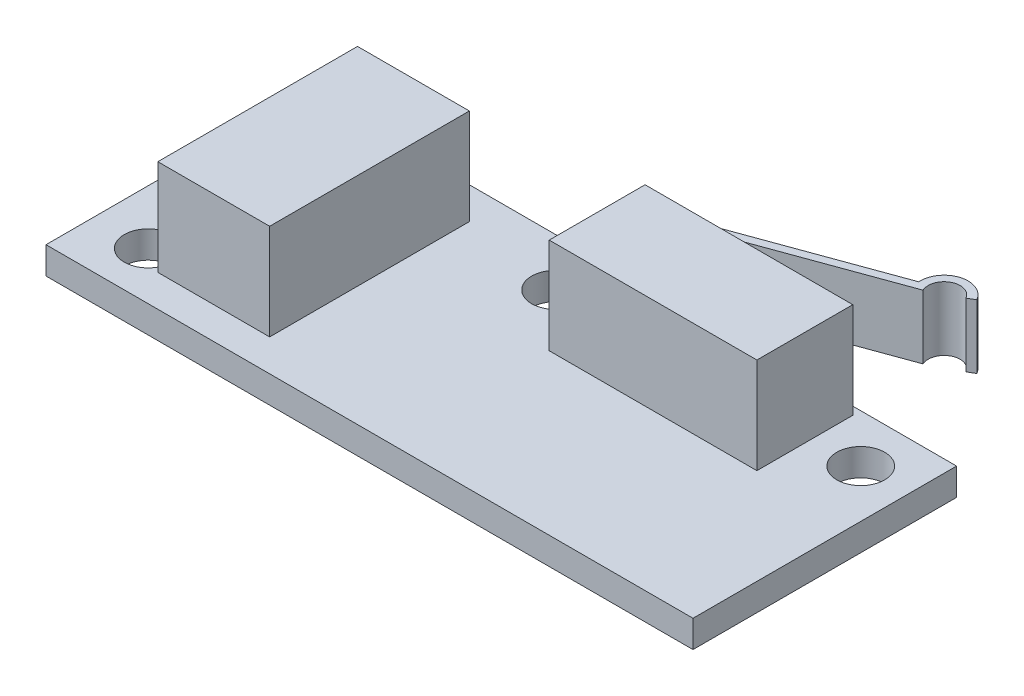
ISO-10303-21;
HEADER;
FILE_DESCRIPTION(('STEP AP214'),'2;1');
FILE_NAME('part.step','',(''),(''),'','','');
FILE_SCHEMA(('AUTOMOTIVE_DESIGN { 1 0 10303 214 1 1 1 1 }'));
ENDSEC;
DATA;
#1=APPLICATION_CONTEXT('core data for automotive mechanical design processes');
#2=APPLICATION_PROTOCOL_DEFINITION('international standard','automotive_design',2000,#1);
#3=PRODUCT_CONTEXT('',#1,'mechanical');
#4=PRODUCT('Part','Part','',(#3));
#5=PRODUCT_RELATED_PRODUCT_CATEGORY('part','',(#4));
#6=PRODUCT_DEFINITION_FORMATION('','',#4);
#7=PRODUCT_DEFINITION_CONTEXT('part definition',#1,'design');
#8=PRODUCT_DEFINITION('design','',#6,#7);
#9=PRODUCT_DEFINITION_SHAPE('','',#8);
#10=(LENGTH_UNIT() NAMED_UNIT(*) SI_UNIT(.MILLI.,.METRE.));
#11=(NAMED_UNIT(*) PLANE_ANGLE_UNIT() SI_UNIT($,.RADIAN.));
#12=(NAMED_UNIT(*) SI_UNIT($,.STERADIAN.) SOLID_ANGLE_UNIT());
#13=UNCERTAINTY_MEASURE_WITH_UNIT(LENGTH_MEASURE(1.E-05),#10,'distance_accuracy_value','');
#14=(GEOMETRIC_REPRESENTATION_CONTEXT(3) GLOBAL_UNCERTAINTY_ASSIGNED_CONTEXT((#13)) GLOBAL_UNIT_ASSIGNED_CONTEXT((#10,
#11,#12)) REPRESENTATION_CONTEXT('',''));
#15=CARTESIAN_POINT('',(0.,0.,0.));
#16=DIRECTION('',(0.,0.,1.));
#17=DIRECTION('',(1.,0.,0.));
#18=AXIS2_PLACEMENT_3D('',#15,#16,#17);
#19=CARTESIAN_POINT('',(5.,7.7,-14.5));
#20=DIRECTION('',(1.,0.,0.));
#21=DIRECTION('',(0.,0.,-1.));
#22=AXIS2_PLACEMENT_3D('',#19,#20,#21);
#23=PLANE('',#22);
#24=DIRECTION('',(0.,0.,1.));
#25=VECTOR('',#24,1.);
#26=CARTESIAN_POINT('',(5.,1.7,-14.5));
#27=LINE('',#26,#25);
#28=CARTESIAN_POINT('',(5.,1.7,-14.5));
#29=VERTEX_POINT('',#28);
#30=CARTESIAN_POINT('',(5.,1.7,-2.));
#31=VERTEX_POINT('',#30);
#32=EDGE_CURVE('E153',#29,#31,#27,.T.);
#33=ORIENTED_EDGE('',*,*,#32,.T.);
#34=DIRECTION('',(0.,-1.,0.));
#35=VECTOR('',#34,1.);
#36=CARTESIAN_POINT('',(5.,7.7,-2.));
#37=LINE('',#36,#35);
#38=CARTESIAN_POINT('',(5.,7.7,-2.));
#39=VERTEX_POINT('',#38);
#40=EDGE_CURVE('E12',#39,#31,#37,.T.);
#41=ORIENTED_EDGE('',*,*,#40,.F.);
#42=DIRECTION('',(0.,0.,1.));
#43=VECTOR('',#42,1.);
#44=CARTESIAN_POINT('',(5.,7.7,-14.5));
#45=LINE('',#44,#43);
#46=CARTESIAN_POINT('',(5.,7.7,-14.5));
#47=VERTEX_POINT('',#46);
#48=EDGE_CURVE('E158',#47,#39,#45,.T.);
#49=ORIENTED_EDGE('',*,*,#48,.F.);
#50=DIRECTION('',(0.,-1.,0.));
#51=VECTOR('',#50,1.);
#52=CARTESIAN_POINT('',(5.,7.7,-14.5));
#53=LINE('',#52,#51);
#54=EDGE_CURVE('E164',#47,#29,#53,.T.);
#55=ORIENTED_EDGE('',*,*,#54,.T.);
#56=EDGE_LOOP('',(#33,#41,#49,#55));
#57=FACE_BOUND('',#56,.T.);
#58=DIRECTION('',(0.,0.,1.));
#59=VECTOR('',#58,1.);
#60=CARTESIAN_POINT('',(5.,2.2,-14.5));
#61=LINE('',#60,#59);
#62=CARTESIAN_POINT('',(5.,2.2,-14.));
#63=VERTEX_POINT('',#62);
#64=CARTESIAN_POINT('',(5.,2.2,-2.5));
#65=VERTEX_POINT('',#64);
#66=EDGE_CURVE('E124',#63,#65,#61,.T.);
#67=ORIENTED_EDGE('',*,*,#66,.F.);
#68=DIRECTION('',(0.,-1.,0.));
#69=VECTOR('',#68,1.);
#70=CARTESIAN_POINT('',(5.,7.7,-14.));
#71=LINE('',#70,#69);
#72=CARTESIAN_POINT('',(5.,7.2,-14.));
#73=VERTEX_POINT('',#72);
#74=EDGE_CURVE('E147',#73,#63,#71,.T.);
#75=ORIENTED_EDGE('',*,*,#74,.F.);
#76=DIRECTION('',(0.,0.,1.));
#77=VECTOR('',#76,1.);
#78=CARTESIAN_POINT('',(5.,7.2,-14.5));
#79=LINE('',#78,#77);
#80=CARTESIAN_POINT('',(5.,7.2,-2.5));
#81=VERTEX_POINT('',#80);
#82=EDGE_CURVE('E58',#73,#81,#79,.T.);
#83=ORIENTED_EDGE('',*,*,#82,.T.);
#84=DIRECTION('',(0.,-1.,0.));
#85=VECTOR('',#84,1.);
#86=CARTESIAN_POINT('',(5.,7.7,-2.5));
#87=LINE('',#86,#85);
#88=EDGE_CURVE('E135',#81,#65,#87,.T.);
#89=ORIENTED_EDGE('',*,*,#88,.T.);
#90=EDGE_LOOP('',(#67,#75,#83,#89));
#91=FACE_BOUND('',#90,.T.);
#92=ADVANCED_FACE('F44',(#57,#91),#23,.F.);
#93=CARTESIAN_POINT('',(5.,7.7,-2.));
#94=DIRECTION('',(0.,0.,-1.));
#95=DIRECTION('',(-1.,0.,0.));
#96=AXIS2_PLACEMENT_3D('',#93,#94,#95);
#97=PLANE('',#96);
#98=DIRECTION('',(1.,0.,0.));
#99=VECTOR('',#98,1.);
#100=CARTESIAN_POINT('',(5.,1.7,-2.));
#101=LINE('',#100,#99);
#102=CARTESIAN_POINT('',(12.,1.7,-2.));
#103=VERTEX_POINT('',#102);
#104=EDGE_CURVE('E167',#31,#103,#101,.T.);
#105=ORIENTED_EDGE('',*,*,#104,.T.);
#106=DIRECTION('',(0.,-1.,0.));
#107=VECTOR('',#106,1.);
#108=CARTESIAN_POINT('',(12.,7.7,-2.));
#109=LINE('',#108,#107);
#110=CARTESIAN_POINT('',(12.,7.7,-2.));
#111=VERTEX_POINT('',#110);
#112=EDGE_CURVE('E51',#111,#103,#109,.T.);
#113=ORIENTED_EDGE('',*,*,#112,.F.);
#114=DIRECTION('',(1.,0.,0.));
#115=VECTOR('',#114,1.);
#116=CARTESIAN_POINT('',(5.,7.7,-2.));
#117=LINE('',#116,#115);
#118=EDGE_CURVE('E95',#39,#111,#117,.T.);
#119=ORIENTED_EDGE('',*,*,#118,.F.);
#120=ORIENTED_EDGE('',*,*,#40,.T.);
#121=EDGE_LOOP('',(#105,#113,#119,#120));
#122=FACE_BOUND('',#121,.T.);
#123=ADVANCED_FACE('F196',(#122),#97,.F.);
#124=CARTESIAN_POINT('',(12.,7.7,-14.5));
#125=DIRECTION('',(-1.,0.,0.));
#126=DIRECTION('',(0.,0.,1.));
#127=AXIS2_PLACEMENT_3D('',#124,#125,#126);
#128=PLANE('',#127);
#129=DIRECTION('',(0.,0.,-1.));
#130=VECTOR('',#129,1.);
#131=CARTESIAN_POINT('',(12.,1.7,-14.5));
#132=LINE('',#131,#130);
#133=CARTESIAN_POINT('',(12.,1.7,-14.5));
#134=VERTEX_POINT('',#133);
#135=EDGE_CURVE('E169',#103,#134,#132,.T.);
#136=ORIENTED_EDGE('',*,*,#135,.T.);
#137=DIRECTION('',(0.,-1.,0.));
#138=VECTOR('',#137,1.);
#139=CARTESIAN_POINT('',(12.,7.7,-14.5));
#140=LINE('',#139,#138);
#141=CARTESIAN_POINT('',(12.,7.7,-14.5));
#142=VERTEX_POINT('',#141);
#143=EDGE_CURVE('E173',#142,#134,#140,.T.);
#144=ORIENTED_EDGE('',*,*,#143,.F.);
#145=DIRECTION('',(0.,0.,-1.));
#146=VECTOR('',#145,1.);
#147=CARTESIAN_POINT('',(12.,7.7,-14.5));
#148=LINE('',#147,#146);
#149=EDGE_CURVE('E161',#111,#142,#148,.T.);
#150=ORIENTED_EDGE('',*,*,#149,.F.);
#151=ORIENTED_EDGE('',*,*,#112,.T.);
#152=EDGE_LOOP('',(#136,#144,#150,#151));
#153=FACE_BOUND('',#152,.T.);
#154=ADVANCED_FACE('F178',(#153),#128,.F.);
#155=CARTESIAN_POINT('',(5.,7.7,-14.5));
#156=DIRECTION('',(0.,0.,1.));
#157=DIRECTION('',(1.,0.,0.));
#158=AXIS2_PLACEMENT_3D('',#155,#156,#157);
#159=PLANE('',#158);
#160=DIRECTION('',(-1.,0.,0.));
#161=VECTOR('',#160,1.);
#162=CARTESIAN_POINT('',(5.,1.7,-14.5));
#163=LINE('',#162,#161);
#164=EDGE_CURVE('E88',#134,#29,#163,.T.);
#165=ORIENTED_EDGE('',*,*,#164,.T.);
#166=ORIENTED_EDGE('',*,*,#54,.F.);
#167=DIRECTION('',(-1.,0.,0.));
#168=VECTOR('',#167,1.);
#169=CARTESIAN_POINT('',(5.,7.7,-14.5));
#170=LINE('',#169,#168);
#171=EDGE_CURVE('E67',#142,#47,#170,.T.);
#172=ORIENTED_EDGE('',*,*,#171,.F.);
#173=ORIENTED_EDGE('',*,*,#143,.T.);
#174=EDGE_LOOP('',(#165,#166,#172,#173));
#175=FACE_BOUND('',#174,.T.);
#176=ADVANCED_FACE('F187',(#175),#159,.F.);
#177=CARTESIAN_POINT('',(0.,7.7,0.));
#178=DIRECTION('',(0.,1.,0.));
#179=DIRECTION('',(0.,0.,1.));
#180=AXIS2_PLACEMENT_3D('',#177,#178,#179);
#181=PLANE('',#180);
#182=ORIENTED_EDGE('',*,*,#48,.T.);
#183=ORIENTED_EDGE('',*,*,#118,.T.);
#184=ORIENTED_EDGE('',*,*,#149,.T.);
#185=ORIENTED_EDGE('',*,*,#171,.T.);
#186=EDGE_LOOP('',(#182,#183,#184,#185));
#187=FACE_BOUND('',#186,.T.);
#188=ADVANCED_FACE('F189',(#187),#181,.T.);
#189=CARTESIAN_POINT('',(0.,1.7,0.));
#190=DIRECTION('',(0.,1.,0.));
#191=DIRECTION('',(0.,0.,1.));
#192=AXIS2_PLACEMENT_3D('',#189,#190,#191);
#193=PLANE('',#192);
#194=ORIENTED_EDGE('',*,*,#32,.F.);
#195=ORIENTED_EDGE('',*,*,#164,.F.);
#196=ORIENTED_EDGE('',*,*,#135,.F.);
#197=ORIENTED_EDGE('',*,*,#104,.F.);
#198=EDGE_LOOP('',(#194,#195,#196,#197));
#199=FACE_BOUND('',#198,.T.);
#200=ADVANCED_FACE('F182',(#199),#193,.F.);
#201=CARTESIAN_POINT('',(5.,7.7,-2.5));
#202=DIRECTION('',(0.,0.,-1.));
#203=DIRECTION('',(-1.,0.,0.));
#204=AXIS2_PLACEMENT_3D('',#201,#202,#203);
#205=PLANE('',#204);
#206=DIRECTION('',(1.,0.,0.));
#207=VECTOR('',#206,1.);
#208=CARTESIAN_POINT('',(5.,2.2,-2.5));
#209=LINE('',#208,#207);
#210=CARTESIAN_POINT('',(11.5,2.2,-2.5));
#211=VERTEX_POINT('',#210);
#212=EDGE_CURVE('E117',#65,#211,#209,.T.);
#213=ORIENTED_EDGE('',*,*,#212,.F.);
#214=ORIENTED_EDGE('',*,*,#88,.F.);
#215=DIRECTION('',(1.,0.,0.));
#216=VECTOR('',#215,1.);
#217=CARTESIAN_POINT('',(5.,7.2,-2.5));
#218=LINE('',#217,#216);
#219=CARTESIAN_POINT('',(11.5,7.2,-2.5));
#220=VERTEX_POINT('',#219);
#221=EDGE_CURVE('E132',#81,#220,#218,.T.);
#222=ORIENTED_EDGE('',*,*,#221,.T.);
#223=DIRECTION('',(0.,-1.,0.));
#224=VECTOR('',#223,1.);
#225=CARTESIAN_POINT('',(11.5,7.7,-2.5));
#226=LINE('',#225,#224);
#227=EDGE_CURVE('E130',#220,#211,#226,.T.);
#228=ORIENTED_EDGE('',*,*,#227,.T.);
#229=EDGE_LOOP('',(#213,#214,#222,#228));
#230=FACE_BOUND('',#229,.T.);
#231=ADVANCED_FACE('F131',(#230),#205,.T.);
#232=CARTESIAN_POINT('',(11.5,7.7,-14.5));
#233=DIRECTION('',(-1.,0.,0.));
#234=DIRECTION('',(0.,0.,1.));
#235=AXIS2_PLACEMENT_3D('',#232,#233,#234);
#236=PLANE('',#235);
#237=DIRECTION('',(0.,0.,-1.));
#238=VECTOR('',#237,1.);
#239=CARTESIAN_POINT('',(11.5,2.2,-14.5));
#240=LINE('',#239,#238);
#241=CARTESIAN_POINT('',(11.5,2.2,-14.));
#242=VERTEX_POINT('',#241);
#243=EDGE_CURVE('E121',#211,#242,#240,.T.);
#244=ORIENTED_EDGE('',*,*,#243,.F.);
#245=ORIENTED_EDGE('',*,*,#227,.F.);
#246=DIRECTION('',(0.,0.,-1.));
#247=VECTOR('',#246,1.);
#248=CARTESIAN_POINT('',(11.5,7.2,-14.5));
#249=LINE('',#248,#247);
#250=CARTESIAN_POINT('',(11.5,7.2,-14.));
#251=VERTEX_POINT('',#250);
#252=EDGE_CURVE('E148',#220,#251,#249,.T.);
#253=ORIENTED_EDGE('',*,*,#252,.T.);
#254=DIRECTION('',(0.,-1.,0.));
#255=VECTOR('',#254,1.);
#256=CARTESIAN_POINT('',(11.5,7.7,-14.));
#257=LINE('',#256,#255);
#258=EDGE_CURVE('E136',#251,#242,#257,.T.);
#259=ORIENTED_EDGE('',*,*,#258,.T.);
#260=EDGE_LOOP('',(#244,#245,#253,#259));
#261=FACE_BOUND('',#260,.T.);
#262=ADVANCED_FACE('F138',(#261),#236,.T.);
#263=CARTESIAN_POINT('',(5.,7.7,-14.));
#264=DIRECTION('',(0.,0.,1.));
#265=DIRECTION('',(1.,0.,0.));
#266=AXIS2_PLACEMENT_3D('',#263,#264,#265);
#267=PLANE('',#266);
#268=DIRECTION('',(-1.,0.,0.));
#269=VECTOR('',#268,1.);
#270=CARTESIAN_POINT('',(5.,2.2,-14.));
#271=LINE('',#270,#269);
#272=EDGE_CURVE('E141',#242,#63,#271,.T.);
#273=ORIENTED_EDGE('',*,*,#272,.F.);
#274=ORIENTED_EDGE('',*,*,#258,.F.);
#275=DIRECTION('',(-1.,0.,0.));
#276=VECTOR('',#275,1.);
#277=CARTESIAN_POINT('',(5.,7.2,-14.));
#278=LINE('',#277,#276);
#279=EDGE_CURVE('E149',#251,#73,#278,.T.);
#280=ORIENTED_EDGE('',*,*,#279,.T.);
#281=ORIENTED_EDGE('',*,*,#74,.T.);
#282=EDGE_LOOP('',(#273,#274,#280,#281));
#283=FACE_BOUND('',#282,.T.);
#284=ADVANCED_FACE('F247',(#283),#267,.T.);
#285=CARTESIAN_POINT('',(0.,7.2,0.));
#286=DIRECTION('',(0.,1.,0.));
#287=DIRECTION('',(0.,0.,1.));
#288=AXIS2_PLACEMENT_3D('',#285,#286,#287);
#289=PLANE('',#288);
#290=ORIENTED_EDGE('',*,*,#82,.F.);
#291=ORIENTED_EDGE('',*,*,#279,.F.);
#292=ORIENTED_EDGE('',*,*,#252,.F.);
#293=ORIENTED_EDGE('',*,*,#221,.F.);
#294=EDGE_LOOP('',(#290,#291,#292,#293));
#295=FACE_BOUND('',#294,.T.);
#296=ADVANCED_FACE('F256',(#295),#289,.F.);
#297=CARTESIAN_POINT('',(0.,2.2,0.));
#298=DIRECTION('',(0.,1.,0.));
#299=DIRECTION('',(0.,0.,1.));
#300=AXIS2_PLACEMENT_3D('',#297,#298,#299);
#301=PLANE('',#300);
#302=ORIENTED_EDGE('',*,*,#66,.T.);
#303=ORIENTED_EDGE('',*,*,#212,.T.);
#304=ORIENTED_EDGE('',*,*,#243,.T.);
#305=ORIENTED_EDGE('',*,*,#272,.T.);
#306=EDGE_LOOP('',(#302,#303,#304,#305));
#307=FACE_BOUND('',#306,.T.);
#308=ADVANCED_FACE('F119',(#307),#301,.T.);
#309=CLOSED_SHELL('',(#92,#123,#154,#176,#188,#200,#231,#262,#284,#296,#308));
#310=MANIFOLD_SOLID_BREP('B2',#309);
#311=CARTESIAN_POINT('',(35.8211998261844,7.7,-20.3976832474202));
#312=DIRECTION('',(0.,-1.,0.));
#313=DIRECTION('',(0.,0.,-1.));
#314=AXIS2_PLACEMENT_3D('',#311,#312,#313);
#315=CYLINDRICAL_SURFACE('',#314,1.);
#316=CARTESIAN_POINT('',(35.8211998261844,2.7,-20.3976832474202));
#317=DIRECTION('',(0.,-1.,0.));
#318=DIRECTION('',(0.,0.,-1.));
#319=AXIS2_PLACEMENT_3D('',#316,#317,#318);
#320=CIRCLE('',#319,1.);
#321=CARTESIAN_POINT('',(36.6872252299689,2.7,-20.8976832474202));
#322=VERTEX_POINT('',#321);
#323=CARTESIAN_POINT('',(34.9103640865516,2.7,-19.9849142376731));
#324=VERTEX_POINT('',#323);
#325=EDGE_CURVE('E543',#322,#324,#320,.F.);
#326=ORIENTED_EDGE('',*,*,#325,.F.);
#327=DIRECTION('',(0.,-1.,0.));
#328=VECTOR('',#327,1.);
#329=CARTESIAN_POINT('',(36.6872252299689,7.7,-20.8976832474202));
#330=LINE('',#329,#328);
#331=CARTESIAN_POINT('',(36.6872252299689,6.7,-20.8976832474202));
#332=VERTEX_POINT('',#331);
#333=EDGE_CURVE('E427',#332,#322,#330,.T.);
#334=ORIENTED_EDGE('',*,*,#333,.F.);
#335=CARTESIAN_POINT('',(35.8211998261844,6.7,-20.3976832474202));
#336=DIRECTION('',(0.,-1.,0.));
#337=DIRECTION('',(0.,0.,-1.));
#338=AXIS2_PLACEMENT_3D('',#335,#336,#337);
#339=CIRCLE('',#338,1.);
#340=CARTESIAN_POINT('',(34.9103640865516,6.7,-19.9849142376731));
#341=VERTEX_POINT('',#340);
#342=EDGE_CURVE('E532',#332,#341,#339,.F.);
#343=ORIENTED_EDGE('',*,*,#342,.T.);
#344=DIRECTION('',(0.,-1.,0.));
#345=VECTOR('',#344,1.);
#346=CARTESIAN_POINT('',(34.9103640865516,7.7,-19.9849142376731));
#347=LINE('',#346,#345);
#348=EDGE_CURVE('E435',#341,#324,#347,.T.);
#349=ORIENTED_EDGE('',*,*,#348,.T.);
#350=EDGE_LOOP('',(#326,#334,#343,#349));
#351=FACE_BOUND('',#350,.T.);
#352=ADVANCED_FACE('F282',(#351),#315,.F.);
#353=CARTESIAN_POINT('',(36.6872252299689,7.7,-20.8976832474202));
#354=DIRECTION('',(-0.500000000000004,0.,-0.866025403784436));
#355=DIRECTION('',(-0.866025403784437,0.,0.500000000000004));
#356=AXIS2_PLACEMENT_3D('',#353,#354,#355);
#357=PLANE('',#356);
#358=DIRECTION('',(-0.866025403784437,0.,0.500000000000004));
#359=VECTOR('',#358,1.);
#360=CARTESIAN_POINT('',(36.6872252299689,2.7,-20.8976832474202));
#361=LINE('',#360,#359);
#362=CARTESIAN_POINT('',(37.1202379318611,2.7,-21.1476832474202));
#363=VERTEX_POINT('',#362);
#364=EDGE_CURVE('E545',#363,#322,#361,.T.);
#365=ORIENTED_EDGE('',*,*,#364,.F.);
#366=DIRECTION('',(0.,-1.,0.));
#367=VECTOR('',#366,1.);
#368=CARTESIAN_POINT('',(37.1202379318611,7.7,-21.1476832474202));
#369=LINE('',#368,#367);
#370=CARTESIAN_POINT('',(37.1202379318611,6.7,-21.1476832474202));
#371=VERTEX_POINT('',#370);
#372=EDGE_CURVE('E424',#371,#363,#369,.T.);
#373=ORIENTED_EDGE('',*,*,#372,.F.);
#374=DIRECTION('',(-0.866025403784437,0.,0.500000000000004));
#375=VECTOR('',#374,1.);
#376=CARTESIAN_POINT('',(36.6872252299689,6.7,-20.8976832474202));
#377=LINE('',#376,#375);
#378=EDGE_CURVE('E535',#371,#332,#377,.T.);
#379=ORIENTED_EDGE('',*,*,#378,.T.);
#380=ORIENTED_EDGE('',*,*,#333,.T.);
#381=EDGE_LOOP('',(#365,#373,#379,#380));
#382=FACE_BOUND('',#381,.T.);
#383=ADVANCED_FACE('F593',(#382),#357,.F.);
#384=CARTESIAN_POINT('',(35.8211998261844,7.7,-20.3976832474202));
#385=DIRECTION('',(0.,-1.,0.));
#386=DIRECTION('',(0.,0.,-1.));
#387=AXIS2_PLACEMENT_3D('',#384,#385,#386);
#388=CYLINDRICAL_SURFACE('',#387,1.5);
#389=CARTESIAN_POINT('',(35.8211998261844,2.7,-20.3976832474202));
#390=DIRECTION('',(0.,-1.,0.));
#391=DIRECTION('',(0.,0.,-1.));
#392=AXIS2_PLACEMENT_3D('',#389,#390,#391);
#393=CIRCLE('',#392,1.5);
#394=CARTESIAN_POINT('',(34.3241508389163,2.7,-20.3036389508393));
#395=VERTEX_POINT('',#394);
#396=EDGE_CURVE('E547',#395,#363,#393,.T.);
#397=ORIENTED_EDGE('',*,*,#396,.F.);
#398=DIRECTION('',(0.,-1.,0.));
#399=VECTOR('',#398,1.);
#400=CARTESIAN_POINT('',(34.3241508389163,7.7,-20.3036389508393));
#401=LINE('',#400,#399);
#402=CARTESIAN_POINT('',(34.3241508389163,6.7,-20.3036389508393));
#403=VERTEX_POINT('',#402);
#404=EDGE_CURVE('E422',#403,#395,#401,.T.);
#405=ORIENTED_EDGE('',*,*,#404,.F.);
#406=CARTESIAN_POINT('',(35.8211998261844,6.7,-20.3976832474202));
#407=DIRECTION('',(0.,-1.,0.));
#408=DIRECTION('',(0.,0.,-1.));
#409=AXIS2_PLACEMENT_3D('',#406,#407,#408);
#410=CIRCLE('',#409,1.5);
#411=EDGE_CURVE('E538',#403,#371,#410,.T.);
#412=ORIENTED_EDGE('',*,*,#411,.T.);
#413=ORIENTED_EDGE('',*,*,#372,.T.);
#414=EDGE_LOOP('',(#397,#405,#412,#413));
#415=FACE_BOUND('',#414,.T.);
#416=ADVANCED_FACE('F599',(#415),#388,.T.);
#417=CARTESIAN_POINT('',(0.,1.7,0.));
#418=DIRECTION('',(0.,-1.,0.));
#419=DIRECTION('',(0.,0.,-1.));
#420=AXIS2_PLACEMENT_3D('',#417,#418,#419);
#421=PLANE('',#420);
#422=CARTESIAN_POINT('',(37.5,1.7,-13.5));
#423=DIRECTION('',(0.,1.,0.));
#424=DIRECTION('',(0.,0.,1.));
#425=AXIS2_PLACEMENT_3D('',#422,#423,#424);
#426=CIRCLE('',#425,1.5);
#427=CARTESIAN_POINT('',(37.5,1.7,-12.));
#428=VERTEX_POINT('',#427);
#429=EDGE_CURVE('E451',#428,#428,#426,.T.);
#430=ORIENTED_EDGE('',*,*,#429,.F.);
#431=EDGE_LOOP('',(#430));
#432=FACE_BOUND('',#431,.T.);
#433=CARTESIAN_POINT('',(18.4,1.7,-13.5));
#434=DIRECTION('',(0.,1.,0.));
#435=DIRECTION('',(0.,0.,1.));
#436=AXIS2_PLACEMENT_3D('',#433,#434,#435);
#437=CIRCLE('',#436,1.5);
#438=CARTESIAN_POINT('',(18.4,1.7,-12.));
#439=VERTEX_POINT('',#438);
#440=EDGE_CURVE('E457',#439,#439,#437,.T.);
#441=ORIENTED_EDGE('',*,*,#440,.F.);
#442=EDGE_LOOP('',(#441));
#443=FACE_BOUND('',#442,.T.);
#444=CARTESIAN_POINT('',(3.4,1.7,-13.5));
#445=DIRECTION('',(0.,1.,0.));
#446=DIRECTION('',(0.,0.,1.));
#447=AXIS2_PLACEMENT_3D('',#444,#445,#446);
#448=CIRCLE('',#447,1.5);
#449=CARTESIAN_POINT('',(3.4,1.7,-12.));
#450=VERTEX_POINT('',#449);
#451=EDGE_CURVE('E463',#450,#450,#448,.T.);
#452=ORIENTED_EDGE('',*,*,#451,.F.);
#453=EDGE_LOOP('',(#452));
#454=FACE_BOUND('',#453,.T.);
#455=CARTESIAN_POINT('',(3.4,1.7,-3.));
#456=DIRECTION('',(0.,1.,0.));
#457=DIRECTION('',(0.,0.,1.));
#458=AXIS2_PLACEMENT_3D('',#455,#456,#457);
#459=CIRCLE('',#458,1.5);
#460=CARTESIAN_POINT('',(3.4,1.7,-1.5));
#461=VERTEX_POINT('',#460);
#462=EDGE_CURVE('E469',#461,#461,#459,.T.);
#463=ORIENTED_EDGE('',*,*,#462,.F.);
#464=EDGE_LOOP('',(#463));
#465=FACE_BOUND('',#464,.T.);
#466=DIRECTION('',(-0.939692620785908,0.,0.34202014332567));
#467=VECTOR('',#466,1.);
#468=CARTESIAN_POINT('',(22.5,1.7,-16.));
#469=LINE('',#468,#467);
#470=CARTESIAN_POINT('',(23.8737387097273,1.7,-16.5));
#471=VERTEX_POINT('',#470);
#472=CARTESIAN_POINT('',(22.5,1.7,-16.));
#473=VERTEX_POINT('',#472);
#474=EDGE_CURVE('E503',#471,#473,#469,.T.);
#475=ORIENTED_EDGE('',*,*,#474,.F.);
#476=DIRECTION('',(-1.,0.,0.));
#477=VECTOR('',#476,1.);
#478=CARTESIAN_POINT('',(0.,1.7,-16.5));
#479=LINE('',#478,#477);
#480=CARTESIAN_POINT('',(0.,1.7,-16.5));
#481=VERTEX_POINT('',#480);
#482=EDGE_CURVE('E413',#471,#481,#479,.T.);
#483=ORIENTED_EDGE('',*,*,#482,.T.);
#484=DIRECTION('',(0.,0.,1.));
#485=VECTOR('',#484,1.);
#486=CARTESIAN_POINT('',(0.,1.7,0.));
#487=LINE('',#486,#485);
#488=CARTESIAN_POINT('',(0.,1.7,0.));
#489=VERTEX_POINT('',#488);
#490=EDGE_CURVE('E475',#481,#489,#487,.T.);
#491=ORIENTED_EDGE('',*,*,#490,.T.);
#492=DIRECTION('',(1.,0.,0.));
#493=VECTOR('',#492,1.);
#494=CARTESIAN_POINT('',(0.,1.7,0.));
#495=LINE('',#494,#493);
#496=CARTESIAN_POINT('',(40.5,1.7,0.));
#497=VERTEX_POINT('',#496);
#498=EDGE_CURVE('E478',#489,#497,#495,.T.);
#499=ORIENTED_EDGE('',*,*,#498,.T.);
#500=DIRECTION('',(0.,0.,-1.));
#501=VECTOR('',#500,1.);
#502=CARTESIAN_POINT('',(40.5,1.7,0.));
#503=LINE('',#502,#501);
#504=CARTESIAN_POINT('',(40.5,1.7,-16.5));
#505=VERTEX_POINT('',#504);
#506=EDGE_CURVE('E481',#497,#505,#503,.T.);
#507=ORIENTED_EDGE('',*,*,#506,.T.);
#508=CARTESIAN_POINT('',(25.3356409098088,1.7,-16.5));
#509=VERTEX_POINT('',#508);
#510=EDGE_CURVE('E483',#505,#509,#479,.T.);
#511=ORIENTED_EDGE('',*,*,#510,.T.);
#512=DIRECTION('',(0.939692620785908,0.,-0.342020143325669));
#513=VECTOR('',#512,1.);
#514=CARTESIAN_POINT('',(23.9619022000816,1.7,-16.));
#515=LINE('',#514,#513);
#516=CARTESIAN_POINT('',(23.9619022000816,1.7,-16.));
#517=VERTEX_POINT('',#516);
#518=EDGE_CURVE('E505',#517,#509,#515,.T.);
#519=ORIENTED_EDGE('',*,*,#518,.F.);
#520=DIRECTION('',(-1.,0.,0.));
#521=VECTOR('',#520,1.);
#522=CARTESIAN_POINT('',(23.9619022000816,1.7,-16.));
#523=LINE('',#522,#521);
#524=CARTESIAN_POINT('',(34.5,1.7,-16.));
#525=VERTEX_POINT('',#524);
#526=EDGE_CURVE('E508',#525,#517,#523,.T.);
#527=ORIENTED_EDGE('',*,*,#526,.F.);
#528=DIRECTION('',(0.,0.,-1.));
#529=VECTOR('',#528,1.);
#530=CARTESIAN_POINT('',(34.5,1.7,-16.));
#531=LINE('',#530,#529);
#532=CARTESIAN_POINT('',(34.5,1.7,-10.));
#533=VERTEX_POINT('',#532);
#534=EDGE_CURVE('E511',#533,#525,#531,.T.);
#535=ORIENTED_EDGE('',*,*,#534,.F.);
#536=DIRECTION('',(1.,0.,0.));
#537=VECTOR('',#536,1.);
#538=CARTESIAN_POINT('',(21.5,1.7,-10.));
#539=LINE('',#538,#537);
#540=CARTESIAN_POINT('',(21.5,1.7,-10.));
#541=VERTEX_POINT('',#540);
#542=EDGE_CURVE('E514',#541,#533,#539,.T.);
#543=ORIENTED_EDGE('',*,*,#542,.F.);
#544=DIRECTION('',(0.,0.,1.));
#545=VECTOR('',#544,1.);
#546=CARTESIAN_POINT('',(21.5,1.7,-16.));
#547=LINE('',#546,#545);
#548=CARTESIAN_POINT('',(21.5,1.7,-16.));
#549=VERTEX_POINT('',#548);
#550=EDGE_CURVE('E517',#549,#541,#547,.T.);
#551=ORIENTED_EDGE('',*,*,#550,.F.);
#552=DIRECTION('',(-1.,0.,0.));
#553=VECTOR('',#552,1.);
#554=CARTESIAN_POINT('',(21.5,1.7,-16.));
#555=LINE('',#554,#553);
#556=EDGE_CURVE('E520',#473,#549,#555,.T.);
#557=ORIENTED_EDGE('',*,*,#556,.F.);
#558=EDGE_LOOP('',(#475,#483,#491,#499,#507,#511,#519,#527,#535,#543,#551,#557));
#559=FACE_BOUND('',#558,.T.);
#560=ADVANCED_FACE('F555',(#432,#443,#454,#465,#559),#421,.F.);
#561=CARTESIAN_POINT('',(0.,0.,0.));
#562=DIRECTION('',(0.,-1.,0.));
#563=DIRECTION('',(0.,0.,-1.));
#564=AXIS2_PLACEMENT_3D('',#561,#562,#563);
#565=PLANE('',#564);
#566=CARTESIAN_POINT('',(18.4,0.,-13.5));
#567=DIRECTION('',(0.,1.,0.));
#568=DIRECTION('',(0.,0.,1.));
#569=AXIS2_PLACEMENT_3D('',#566,#567,#568);
#570=CIRCLE('',#569,1.5);
#571=CARTESIAN_POINT('',(18.4,0.,-12.));
#572=VERTEX_POINT('',#571);
#573=EDGE_CURVE('E454',#572,#572,#570,.T.);
#574=ORIENTED_EDGE('',*,*,#573,.T.);
#575=EDGE_LOOP('',(#574));
#576=FACE_BOUND('',#575,.T.);
#577=CARTESIAN_POINT('',(3.4,0.,-3.));
#578=DIRECTION('',(0.,1.,0.));
#579=DIRECTION('',(0.,0.,1.));
#580=AXIS2_PLACEMENT_3D('',#577,#578,#579);
#581=CIRCLE('',#580,1.5);
#582=CARTESIAN_POINT('',(3.4,0.,-1.5));
#583=VERTEX_POINT('',#582);
#584=EDGE_CURVE('E466',#583,#583,#581,.T.);
#585=ORIENTED_EDGE('',*,*,#584,.T.);
#586=EDGE_LOOP('',(#585));
#587=FACE_BOUND('',#586,.T.);
#588=DIRECTION('',(0.,0.,1.));
#589=VECTOR('',#588,1.);
#590=CARTESIAN_POINT('',(0.,0.,0.));
#591=LINE('',#590,#589);
#592=CARTESIAN_POINT('',(0.,0.,-16.5));
#593=VERTEX_POINT('',#592);
#594=CARTESIAN_POINT('',(0.,0.,0.));
#595=VERTEX_POINT('',#594);
#596=EDGE_CURVE('E472',#593,#595,#591,.T.);
#597=ORIENTED_EDGE('',*,*,#596,.F.);
#598=DIRECTION('',(-1.,0.,0.));
#599=VECTOR('',#598,1.);
#600=CARTESIAN_POINT('',(0.,0.,-16.5));
#601=LINE('',#600,#599);
#602=CARTESIAN_POINT('',(40.5,0.,-16.5));
#603=VERTEX_POINT('',#602);
#604=EDGE_CURVE('E479',#603,#593,#601,.T.);
#605=ORIENTED_EDGE('',*,*,#604,.F.);
#606=DIRECTION('',(0.,0.,-1.));
#607=VECTOR('',#606,1.);
#608=CARTESIAN_POINT('',(40.5,0.,0.));
#609=LINE('',#608,#607);
#610=CARTESIAN_POINT('',(40.5,0.,0.));
#611=VERTEX_POINT('',#610);
#612=EDGE_CURVE('E490',#611,#603,#609,.T.);
#613=ORIENTED_EDGE('',*,*,#612,.F.);
#614=DIRECTION('',(1.,0.,0.));
#615=VECTOR('',#614,1.);
#616=CARTESIAN_POINT('',(0.,0.,0.));
#617=LINE('',#616,#615);
#618=EDGE_CURVE('E488',#595,#611,#617,.T.);
#619=ORIENTED_EDGE('',*,*,#618,.F.);
#620=EDGE_LOOP('',(#597,#605,#613,#619));
#621=FACE_BOUND('',#620,.T.);
#622=CARTESIAN_POINT('',(3.4,0.,-13.5));
#623=DIRECTION('',(0.,1.,0.));
#624=DIRECTION('',(0.,0.,1.));
#625=AXIS2_PLACEMENT_3D('',#622,#623,#624);
#626=CIRCLE('',#625,1.5);
#627=CARTESIAN_POINT('',(3.4,0.,-12.));
#628=VERTEX_POINT('',#627);
#629=EDGE_CURVE('E460',#628,#628,#626,.T.);
#630=ORIENTED_EDGE('',*,*,#629,.T.);
#631=EDGE_LOOP('',(#630));
#632=FACE_BOUND('',#631,.T.);
#633=CARTESIAN_POINT('',(37.5,0.,-13.5));
#634=DIRECTION('',(0.,1.,0.));
#635=DIRECTION('',(0.,0.,1.));
#636=AXIS2_PLACEMENT_3D('',#633,#634,#635);
#637=CIRCLE('',#636,1.5);
#638=CARTESIAN_POINT('',(37.5,0.,-12.));
#639=VERTEX_POINT('',#638);
#640=EDGE_CURVE('E450',#639,#639,#637,.T.);
#641=ORIENTED_EDGE('',*,*,#640,.T.);
#642=EDGE_LOOP('',(#641));
#643=FACE_BOUND('',#642,.T.);
#644=ADVANCED_FACE('F564',(#576,#587,#621,#632,#643),#565,.T.);
#645=CARTESIAN_POINT('',(0.,1.7,0.));
#646=DIRECTION('',(1.,0.,0.));
#647=DIRECTION('',(0.,0.,-1.));
#648=AXIS2_PLACEMENT_3D('',#645,#646,#647);
#649=PLANE('',#648);
#650=ORIENTED_EDGE('',*,*,#596,.T.);
#651=DIRECTION('',(0.,-1.,0.));
#652=VECTOR('',#651,1.);
#653=CARTESIAN_POINT('',(0.,1.7,0.));
#654=LINE('',#653,#652);
#655=EDGE_CURVE('E501',#489,#595,#654,.T.);
#656=ORIENTED_EDGE('',*,*,#655,.F.);
#657=ORIENTED_EDGE('',*,*,#490,.F.);
#658=DIRECTION('',(0.,-1.,0.));
#659=VECTOR('',#658,1.);
#660=CARTESIAN_POINT('',(0.,1.7,-16.5));
#661=LINE('',#660,#659);
#662=EDGE_CURVE('E485',#481,#593,#661,.T.);
#663=ORIENTED_EDGE('',*,*,#662,.T.);
#664=EDGE_LOOP('',(#650,#656,#657,#663));
#665=FACE_BOUND('',#664,.T.);
#666=ADVANCED_FACE('F284',(#665),#649,.F.);
#667=CARTESIAN_POINT('',(0.,1.7,0.));
#668=DIRECTION('',(0.,0.,-1.));
#669=DIRECTION('',(-1.,0.,0.));
#670=AXIS2_PLACEMENT_3D('',#667,#668,#669);
#671=PLANE('',#670);
#672=ORIENTED_EDGE('',*,*,#618,.T.);
#673=DIRECTION('',(0.,-1.,0.));
#674=VECTOR('',#673,1.);
#675=CARTESIAN_POINT('',(40.5,1.7,0.));
#676=LINE('',#675,#674);
#677=EDGE_CURVE('E498',#497,#611,#676,.T.);
#678=ORIENTED_EDGE('',*,*,#677,.F.);
#679=ORIENTED_EDGE('',*,*,#498,.F.);
#680=ORIENTED_EDGE('',*,*,#655,.T.);
#681=EDGE_LOOP('',(#672,#678,#679,#680));
#682=FACE_BOUND('',#681,.T.);
#683=ADVANCED_FACE('F757',(#682),#671,.F.);
#684=CARTESIAN_POINT('',(40.5,1.7,0.));
#685=DIRECTION('',(-1.,0.,0.));
#686=DIRECTION('',(0.,0.,1.));
#687=AXIS2_PLACEMENT_3D('',#684,#685,#686);
#688=PLANE('',#687);
#689=ORIENTED_EDGE('',*,*,#612,.T.);
#690=DIRECTION('',(0.,-1.,0.));
#691=VECTOR('',#690,1.);
#692=CARTESIAN_POINT('',(40.5,1.7,-16.5));
#693=LINE('',#692,#691);
#694=EDGE_CURVE('E495',#505,#603,#693,.T.);
#695=ORIENTED_EDGE('',*,*,#694,.F.);
#696=ORIENTED_EDGE('',*,*,#506,.F.);
#697=ORIENTED_EDGE('',*,*,#677,.T.);
#698=EDGE_LOOP('',(#689,#695,#696,#697));
#699=FACE_BOUND('',#698,.T.);
#700=ADVANCED_FACE('F560',(#699),#688,.F.);
#701=CARTESIAN_POINT('',(0.,1.7,-16.5));
#702=DIRECTION('',(0.,0.,1.));
#703=DIRECTION('',(1.,0.,0.));
#704=AXIS2_PLACEMENT_3D('',#701,#702,#703);
#705=PLANE('',#704);
#706=ORIENTED_EDGE('',*,*,#604,.T.);
#707=ORIENTED_EDGE('',*,*,#662,.F.);
#708=ORIENTED_EDGE('',*,*,#482,.F.);
#709=DIRECTION('',(0.,-1.,0.));
#710=VECTOR('',#709,1.);
#711=CARTESIAN_POINT('',(23.8737387097273,2.7,-16.5));
#712=LINE('',#711,#710);
#713=CARTESIAN_POINT('',(23.8737387097273,2.7,-16.5));
#714=VERTEX_POINT('',#713);
#715=EDGE_CURVE('E408',#714,#471,#712,.T.);
#716=ORIENTED_EDGE('',*,*,#715,.F.);
#717=DIRECTION('',(-1.,0.,0.));
#718=VECTOR('',#717,1.);
#719=CARTESIAN_POINT('',(23.8737387097273,2.7,-16.5));
#720=LINE('',#719,#718);
#721=CARTESIAN_POINT('',(25.3356409098088,2.7,-16.5));
#722=VERTEX_POINT('',#721);
#723=EDGE_CURVE('E398',#722,#714,#720,.T.);
#724=ORIENTED_EDGE('',*,*,#723,.F.);
#725=DIRECTION('',(0.,1.,0.));
#726=VECTOR('',#725,1.);
#727=CARTESIAN_POINT('',(25.3356409098088,7.7,-16.5));
#728=LINE('',#727,#726);
#729=EDGE_CURVE('E417',#509,#722,#728,.T.);
#730=ORIENTED_EDGE('',*,*,#729,.F.);
#731=ORIENTED_EDGE('',*,*,#510,.F.);
#732=ORIENTED_EDGE('',*,*,#694,.T.);
#733=EDGE_LOOP('',(#706,#707,#708,#716,#724,#730,#731,#732));
#734=FACE_BOUND('',#733,.T.);
#735=ADVANCED_FACE('F411',(#734),#705,.F.);
#736=CARTESIAN_POINT('',(3.4,1.7,-3.));
#737=DIRECTION('',(0.,-1.,0.));
#738=DIRECTION('',(0.,0.,-1.));
#739=AXIS2_PLACEMENT_3D('',#736,#737,#738);
#740=CYLINDRICAL_SURFACE('',#739,1.5);
#741=ORIENTED_EDGE('',*,*,#462,.T.);
#742=EDGE_LOOP('',(#741));
#743=FACE_BOUND('',#742,.T.);
#744=ORIENTED_EDGE('',*,*,#584,.F.);
#745=EDGE_LOOP('',(#744));
#746=FACE_BOUND('',#745,.T.);
#747=ADVANCED_FACE('F653',(#743,#746),#740,.F.);
#748=CARTESIAN_POINT('',(3.4,1.7,-13.5));
#749=DIRECTION('',(0.,-1.,0.));
#750=DIRECTION('',(0.,0.,-1.));
#751=AXIS2_PLACEMENT_3D('',#748,#749,#750);
#752=CYLINDRICAL_SURFACE('',#751,1.5);
#753=ORIENTED_EDGE('',*,*,#451,.T.);
#754=EDGE_LOOP('',(#753));
#755=FACE_BOUND('',#754,.T.);
#756=ORIENTED_EDGE('',*,*,#629,.F.);
#757=EDGE_LOOP('',(#756));
#758=FACE_BOUND('',#757,.T.);
#759=ADVANCED_FACE('F731',(#755,#758),#752,.F.);
#760=CARTESIAN_POINT('',(18.4,1.7,-13.5));
#761=DIRECTION('',(0.,-1.,0.));
#762=DIRECTION('',(0.,0.,-1.));
#763=AXIS2_PLACEMENT_3D('',#760,#761,#762);
#764=CYLINDRICAL_SURFACE('',#763,1.5);
#765=ORIENTED_EDGE('',*,*,#440,.T.);
#766=EDGE_LOOP('',(#765));
#767=FACE_BOUND('',#766,.T.);
#768=ORIENTED_EDGE('',*,*,#573,.F.);
#769=EDGE_LOOP('',(#768));
#770=FACE_BOUND('',#769,.T.);
#771=ADVANCED_FACE('F721',(#767,#770),#764,.F.);
#772=CARTESIAN_POINT('',(37.5,1.7,-13.5));
#773=DIRECTION('',(0.,-1.,0.));
#774=DIRECTION('',(0.,0.,-1.));
#775=AXIS2_PLACEMENT_3D('',#772,#773,#774);
#776=CYLINDRICAL_SURFACE('',#775,1.5);
#777=ORIENTED_EDGE('',*,*,#429,.T.);
#778=EDGE_LOOP('',(#777));
#779=FACE_BOUND('',#778,.T.);
#780=ORIENTED_EDGE('',*,*,#640,.F.);
#781=EDGE_LOOP('',(#780));
#782=FACE_BOUND('',#781,.T.);
#783=ADVANCED_FACE('F703',(#779,#782),#776,.F.);
#784=CARTESIAN_POINT('',(21.5,7.7,-16.));
#785=DIRECTION('',(0.,0.,1.));
#786=DIRECTION('',(1.,0.,0.));
#787=AXIS2_PLACEMENT_3D('',#784,#785,#786);
#788=PLANE('',#787);
#789=ORIENTED_EDGE('',*,*,#556,.T.);
#790=DIRECTION('',(0.,-1.,0.));
#791=VECTOR('',#790,1.);
#792=CARTESIAN_POINT('',(21.5,7.7,-16.));
#793=LINE('',#792,#791);
#794=CARTESIAN_POINT('',(21.5,7.7,-16.));
#795=VERTEX_POINT('',#794);
#796=EDGE_CURVE('E447',#795,#549,#793,.T.);
#797=ORIENTED_EDGE('',*,*,#796,.F.);
#798=DIRECTION('',(-1.,0.,0.));
#799=VECTOR('',#798,1.);
#800=CARTESIAN_POINT('',(21.5,7.7,-16.));
#801=LINE('',#800,#799);
#802=CARTESIAN_POINT('',(34.5,7.7,-16.));
#803=VERTEX_POINT('',#802);
#804=EDGE_CURVE('E507',#803,#795,#801,.T.);
#805=ORIENTED_EDGE('',*,*,#804,.F.);
#806=DIRECTION('',(0.,-1.,0.));
#807=VECTOR('',#806,1.);
#808=CARTESIAN_POINT('',(34.5,7.7,-16.));
#809=LINE('',#808,#807);
#810=EDGE_CURVE('E439',#803,#525,#809,.T.);
#811=ORIENTED_EDGE('',*,*,#810,.T.);
#812=ORIENTED_EDGE('',*,*,#526,.T.);
#813=DIRECTION('',(0.,-1.,0.));
#814=VECTOR('',#813,1.);
#815=CARTESIAN_POINT('',(23.9619022000816,7.7,-16.));
#816=LINE('',#815,#814);
#817=CARTESIAN_POINT('',(23.9619022000815,6.7,-16.));
#818=VERTEX_POINT('',#817);
#819=EDGE_CURVE('E305',#818,#517,#816,.T.);
#820=ORIENTED_EDGE('',*,*,#819,.F.);
#821=DIRECTION('',(1.,0.,0.));
#822=VECTOR('',#821,1.);
#823=CARTESIAN_POINT('',(22.5,6.7,-16.));
#824=LINE('',#823,#822);
#825=CARTESIAN_POINT('',(22.5,6.7,-16.));
#826=VERTEX_POINT('',#825);
#827=EDGE_CURVE('E540',#826,#818,#824,.T.);
#828=ORIENTED_EDGE('',*,*,#827,.F.);
#829=DIRECTION('',(0.,-1.,0.));
#830=VECTOR('',#829,1.);
#831=CARTESIAN_POINT('',(22.5,7.7,-16.));
#832=LINE('',#831,#830);
#833=EDGE_CURVE('E297',#826,#473,#832,.T.);
#834=ORIENTED_EDGE('',*,*,#833,.T.);
#835=EDGE_LOOP('',(#789,#797,#805,#811,#812,#820,#828,#834));
#836=FACE_BOUND('',#835,.T.);
#837=ADVANCED_FACE('F570',(#836),#788,.F.);
#838=CARTESIAN_POINT('',(21.5,7.7,-16.));
#839=DIRECTION('',(1.,0.,0.));
#840=DIRECTION('',(0.,0.,-1.));
#841=AXIS2_PLACEMENT_3D('',#838,#839,#840);
#842=PLANE('',#841);
#843=ORIENTED_EDGE('',*,*,#550,.T.);
#844=DIRECTION('',(0.,-1.,0.));
#845=VECTOR('',#844,1.);
#846=CARTESIAN_POINT('',(21.5,7.7,-10.));
#847=LINE('',#846,#845);
#848=CARTESIAN_POINT('',(21.5,7.7,-10.));
#849=VERTEX_POINT('',#848);
#850=EDGE_CURVE('E444',#849,#541,#847,.T.);
#851=ORIENTED_EDGE('',*,*,#850,.F.);
#852=DIRECTION('',(0.,0.,1.));
#853=VECTOR('',#852,1.);
#854=CARTESIAN_POINT('',(21.5,7.7,-16.));
#855=LINE('',#854,#853);
#856=EDGE_CURVE('E527',#795,#849,#855,.T.);
#857=ORIENTED_EDGE('',*,*,#856,.F.);
#858=ORIENTED_EDGE('',*,*,#796,.T.);
#859=EDGE_LOOP('',(#843,#851,#857,#858));
#860=FACE_BOUND('',#859,.T.);
#861=ADVANCED_FACE('F572',(#860),#842,.F.);
#862=CARTESIAN_POINT('',(21.5,7.7,-10.));
#863=DIRECTION('',(0.,0.,-1.));
#864=DIRECTION('',(-1.,0.,0.));
#865=AXIS2_PLACEMENT_3D('',#862,#863,#864);
#866=PLANE('',#865);
#867=ORIENTED_EDGE('',*,*,#542,.T.);
#868=DIRECTION('',(0.,-1.,0.));
#869=VECTOR('',#868,1.);
#870=CARTESIAN_POINT('',(34.5,7.7,-10.));
#871=LINE('',#870,#869);
#872=CARTESIAN_POINT('',(34.5,7.7,-10.));
#873=VERTEX_POINT('',#872);
#874=EDGE_CURVE('E441',#873,#533,#871,.T.);
#875=ORIENTED_EDGE('',*,*,#874,.F.);
#876=DIRECTION('',(1.,0.,0.));
#877=VECTOR('',#876,1.);
#878=CARTESIAN_POINT('',(21.5,7.7,-10.));
#879=LINE('',#878,#877);
#880=EDGE_CURVE('E525',#849,#873,#879,.T.);
#881=ORIENTED_EDGE('',*,*,#880,.F.);
#882=ORIENTED_EDGE('',*,*,#850,.T.);
#883=EDGE_LOOP('',(#867,#875,#881,#882));
#884=FACE_BOUND('',#883,.T.);
#885=ADVANCED_FACE('F583',(#884),#866,.F.);
#886=CARTESIAN_POINT('',(34.5,7.7,-16.));
#887=DIRECTION('',(-1.,0.,0.));
#888=DIRECTION('',(0.,0.,1.));
#889=AXIS2_PLACEMENT_3D('',#886,#887,#888);
#890=PLANE('',#889);
#891=ORIENTED_EDGE('',*,*,#534,.T.);
#892=ORIENTED_EDGE('',*,*,#810,.F.);
#893=DIRECTION('',(0.,0.,-1.));
#894=VECTOR('',#893,1.);
#895=CARTESIAN_POINT('',(34.5,7.7,-16.));
#896=LINE('',#895,#894);
#897=EDGE_CURVE('E429',#873,#803,#896,.T.);
#898=ORIENTED_EDGE('',*,*,#897,.F.);
#899=ORIENTED_EDGE('',*,*,#874,.T.);
#900=EDGE_LOOP('',(#891,#892,#898,#899));
#901=FACE_BOUND('',#900,.T.);
#902=ADVANCED_FACE('F581',(#901),#890,.F.);
#903=CARTESIAN_POINT('',(23.9619022000816,7.7,-16.));
#904=DIRECTION('',(-0.342020143325669,0.,-0.939692620785908));
#905=DIRECTION('',(-0.939692620785908,0.,0.342020143325669));
#906=AXIS2_PLACEMENT_3D('',#903,#904,#905);
#907=PLANE('',#906);
#908=ORIENTED_EDGE('',*,*,#518,.T.);
#909=ORIENTED_EDGE('',*,*,#729,.T.);
#910=DIRECTION('',(-0.939692620785908,0.,0.342020143325669));
#911=VECTOR('',#910,1.);
#912=CARTESIAN_POINT('',(23.9619022000816,2.7,-16.));
#913=LINE('',#912,#911);
#914=EDGE_CURVE('E404',#324,#722,#913,.T.);
#915=ORIENTED_EDGE('',*,*,#914,.F.);
#916=ORIENTED_EDGE('',*,*,#348,.F.);
#917=DIRECTION('',(-0.939692620785908,0.,0.342020143325669));
#918=VECTOR('',#917,1.);
#919=CARTESIAN_POINT('',(23.9619022000816,6.7,-16.));
#920=LINE('',#919,#918);
#921=EDGE_CURVE('E522',#341,#818,#920,.T.);
#922=ORIENTED_EDGE('',*,*,#921,.T.);
#923=ORIENTED_EDGE('',*,*,#819,.T.);
#924=EDGE_LOOP('',(#908,#909,#915,#916,#922,#923));
#925=FACE_BOUND('',#924,.T.);
#926=ADVANCED_FACE('F549',(#925),#907,.F.);
#927=CARTESIAN_POINT('',(22.5,7.7,-16.));
#928=DIRECTION('',(0.34202014332567,0.,0.939692620785908));
#929=DIRECTION('',(0.939692620785908,0.,-0.34202014332567));
#930=AXIS2_PLACEMENT_3D('',#927,#928,#929);
#931=PLANE('',#930);
#932=DIRECTION('',(0.939692620785908,0.,-0.34202014332567));
#933=VECTOR('',#932,1.);
#934=CARTESIAN_POINT('',(22.5,2.7,-16.));
#935=LINE('',#934,#933);
#936=EDGE_CURVE('E42',#714,#395,#935,.T.);
#937=ORIENTED_EDGE('',*,*,#936,.F.);
#938=ORIENTED_EDGE('',*,*,#715,.T.);
#939=ORIENTED_EDGE('',*,*,#474,.T.);
#940=ORIENTED_EDGE('',*,*,#833,.F.);
#941=DIRECTION('',(0.939692620785908,0.,-0.34202014332567));
#942=VECTOR('',#941,1.);
#943=CARTESIAN_POINT('',(22.5,6.7,-16.));
#944=LINE('',#943,#942);
#945=EDGE_CURVE('E290',#826,#403,#944,.T.);
#946=ORIENTED_EDGE('',*,*,#945,.T.);
#947=ORIENTED_EDGE('',*,*,#404,.T.);
#948=EDGE_LOOP('',(#937,#938,#939,#940,#946,#947));
#949=FACE_BOUND('',#948,.T.);
#950=ADVANCED_FACE('F419',(#949),#931,.F.);
#951=CARTESIAN_POINT('',(35.8211998261844,7.7,-20.3976832474202));
#952=DIRECTION('',(0.,-1.,0.));
#953=DIRECTION('',(0.,0.,-1.));
#954=AXIS2_PLACEMENT_3D('',#951,#952,#953);
#955=PLANE('',#954);
#956=ORIENTED_EDGE('',*,*,#897,.T.);
#957=ORIENTED_EDGE('',*,*,#804,.T.);
#958=ORIENTED_EDGE('',*,*,#856,.T.);
#959=ORIENTED_EDGE('',*,*,#880,.T.);
#960=EDGE_LOOP('',(#956,#957,#958,#959));
#961=FACE_BOUND('',#960,.T.);
#962=ADVANCED_FACE('F576',(#961),#955,.F.);
#963=CARTESIAN_POINT('',(0.,6.7,0.));
#964=DIRECTION('',(0.,-1.,0.));
#965=DIRECTION('',(0.,0.,-1.));
#966=AXIS2_PLACEMENT_3D('',#963,#964,#965);
#967=PLANE('',#966);
#968=ORIENTED_EDGE('',*,*,#342,.F.);
#969=ORIENTED_EDGE('',*,*,#378,.F.);
#970=ORIENTED_EDGE('',*,*,#411,.F.);
#971=ORIENTED_EDGE('',*,*,#945,.F.);
#972=ORIENTED_EDGE('',*,*,#827,.T.);
#973=ORIENTED_EDGE('',*,*,#921,.F.);
#974=EDGE_LOOP('',(#968,#969,#970,#971,#972,#973));
#975=FACE_BOUND('',#974,.T.);
#976=ADVANCED_FACE('F613',(#975),#967,.F.);
#977=CARTESIAN_POINT('',(0.,2.7,0.));
#978=DIRECTION('',(0.,-1.,0.));
#979=DIRECTION('',(0.,0.,-1.));
#980=AXIS2_PLACEMENT_3D('',#977,#978,#979);
#981=PLANE('',#980);
#982=ORIENTED_EDGE('',*,*,#914,.T.);
#983=ORIENTED_EDGE('',*,*,#723,.T.);
#984=ORIENTED_EDGE('',*,*,#936,.T.);
#985=ORIENTED_EDGE('',*,*,#396,.T.);
#986=ORIENTED_EDGE('',*,*,#364,.T.);
#987=ORIENTED_EDGE('',*,*,#325,.T.);
#988=EDGE_LOOP('',(#982,#983,#984,#985,#986,#987));
#989=FACE_BOUND('',#988,.T.);
#990=ADVANCED_FACE('F400',(#989),#981,.T.);
#991=CLOSED_SHELL('',(#352,#383,#416,#560,#644,#666,#683,#700,#735,#747,#759,#771,#783,#837,
#861,#885,#902,#926,#950,#962,#976,#990));
#992=MANIFOLD_SOLID_BREP('B6',#991);
#993=ADVANCED_BREP_SHAPE_REPRESENTATION('',(#18,#310,#992),#14);
#994=SHAPE_DEFINITION_REPRESENTATION(#9,#993);
ENDSEC;
END-ISO-10303-21;
